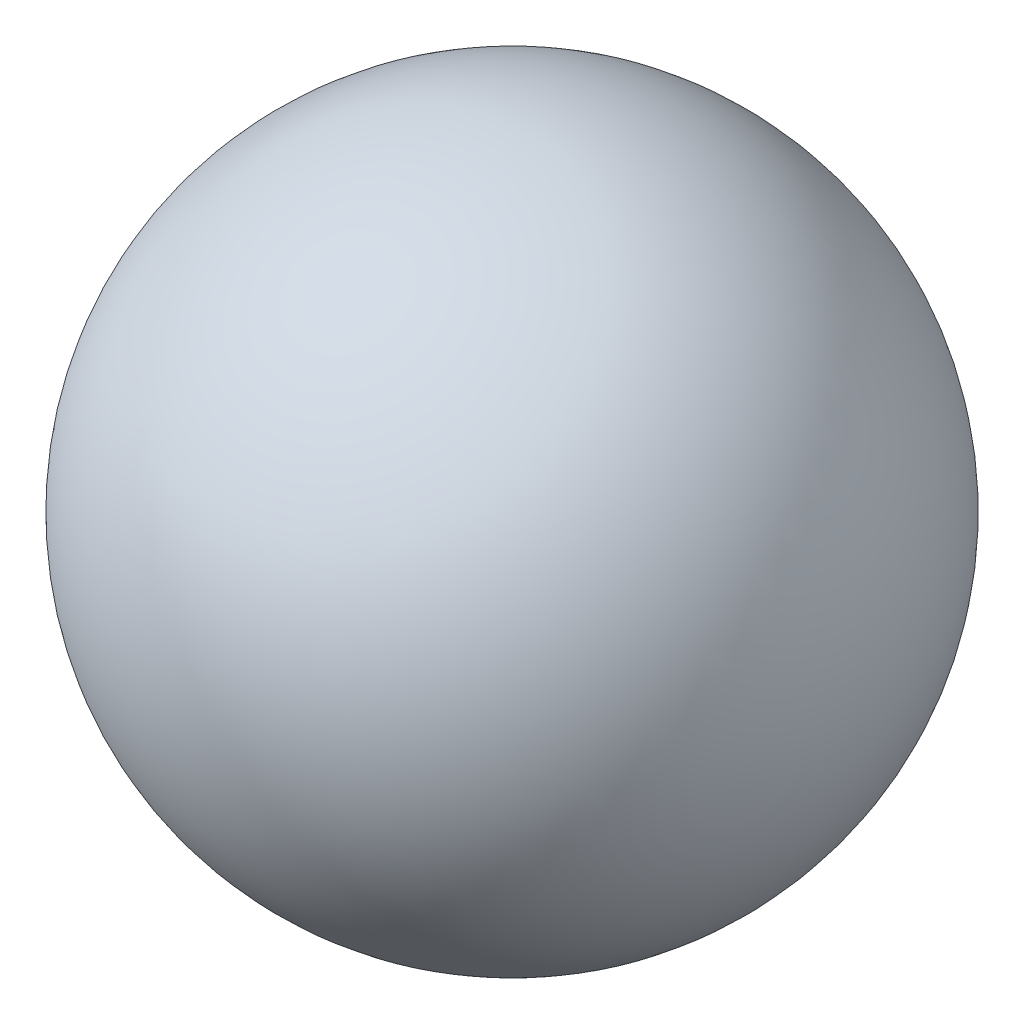
ISO-10303-21;
HEADER;
FILE_DESCRIPTION(('STEP AP214'),'2;1');
FILE_NAME('part.step','',(''),(''),'','','');
FILE_SCHEMA(('AUTOMOTIVE_DESIGN { 1 0 10303 214 1 1 1 1 }'));
ENDSEC;
DATA;
#1=APPLICATION_CONTEXT('core data for automotive mechanical design processes');
#2=APPLICATION_PROTOCOL_DEFINITION('international standard','automotive_design',2000,#1);
#3=PRODUCT_CONTEXT('',#1,'mechanical');
#4=PRODUCT('Part','Part','',(#3));
#5=PRODUCT_RELATED_PRODUCT_CATEGORY('part','',(#4));
#6=PRODUCT_DEFINITION_FORMATION('','',#4);
#7=PRODUCT_DEFINITION_CONTEXT('part definition',#1,'design');
#8=PRODUCT_DEFINITION('design','',#6,#7);
#9=PRODUCT_DEFINITION_SHAPE('','',#8);
#10=(LENGTH_UNIT() NAMED_UNIT(*) SI_UNIT(.MILLI.,.METRE.));
#11=(NAMED_UNIT(*) PLANE_ANGLE_UNIT() SI_UNIT($,.RADIAN.));
#12=(NAMED_UNIT(*) SI_UNIT($,.STERADIAN.) SOLID_ANGLE_UNIT());
#13=UNCERTAINTY_MEASURE_WITH_UNIT(LENGTH_MEASURE(1.E-05),#10,'distance_accuracy_value','');
#14=(GEOMETRIC_REPRESENTATION_CONTEXT(3) GLOBAL_UNCERTAINTY_ASSIGNED_CONTEXT((#13)) GLOBAL_UNIT_ASSIGNED_CONTEXT((#10,
#11,#12)) REPRESENTATION_CONTEXT('',''));
#15=CARTESIAN_POINT('',(0.,0.,0.));
#16=DIRECTION('',(0.,0.,1.));
#17=DIRECTION('',(1.,0.,0.));
#18=AXIS2_PLACEMENT_3D('',#15,#16,#17);
#19=CARTESIAN_POINT('',(0.,0.,0.));
#20=DIRECTION('',(0.,1.,0.));
#21=DIRECTION('',(1.,0.,0.));
#22=AXIS2_PLACEMENT_3D('',#19,#20,#21);
#23=SPHERICAL_SURFACE('',#22,36.);
#24=CARTESIAN_POINT('',(0.,36.,0.));
#25=VERTEX_POINT('',#24);
#26=VERTEX_LOOP('',#25);
#27=FACE_BOUND('',#26,.T.);
#28=ADVANCED_FACE('F39',(#27),#23,.T.);
#29=CLOSED_SHELL('',(#28));
#30=MANIFOLD_SOLID_BREP('B2',#29);
#31=ADVANCED_BREP_SHAPE_REPRESENTATION('',(#18,#30),#14);
#32=SHAPE_DEFINITION_REPRESENTATION(#9,#31);
ENDSEC;
END-ISO-10303-21;
